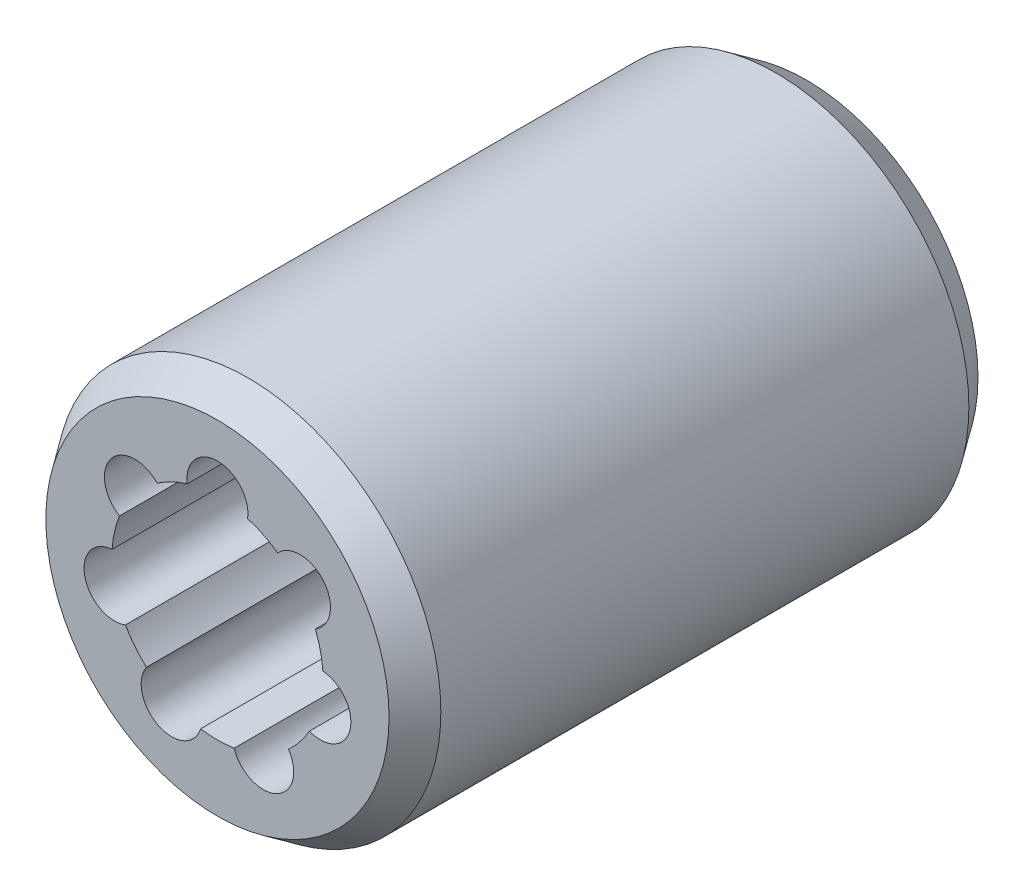
ISO-10303-21;
HEADER;
FILE_DESCRIPTION(('STEP AP214'),'2;1');
FILE_NAME('part.step','',(''),(''),'','','');
FILE_SCHEMA(('AUTOMOTIVE_DESIGN { 1 0 10303 214 1 1 1 1 }'));
ENDSEC;
DATA;
#1=APPLICATION_CONTEXT('core data for automotive mechanical design processes');
#2=APPLICATION_PROTOCOL_DEFINITION('international standard','automotive_design',2000,#1);
#3=PRODUCT_CONTEXT('',#1,'mechanical');
#4=PRODUCT('Part','Part','',(#3));
#5=PRODUCT_RELATED_PRODUCT_CATEGORY('part','',(#4));
#6=PRODUCT_DEFINITION_FORMATION('','',#4);
#7=PRODUCT_DEFINITION_CONTEXT('part definition',#1,'design');
#8=PRODUCT_DEFINITION('design','',#6,#7);
#9=PRODUCT_DEFINITION_SHAPE('','',#8);
#10=(LENGTH_UNIT() NAMED_UNIT(*) SI_UNIT(.MILLI.,.METRE.));
#11=(NAMED_UNIT(*) PLANE_ANGLE_UNIT() SI_UNIT($,.RADIAN.));
#12=(NAMED_UNIT(*) SI_UNIT($,.STERADIAN.) SOLID_ANGLE_UNIT());
#13=UNCERTAINTY_MEASURE_WITH_UNIT(LENGTH_MEASURE(1.E-05),#10,'distance_accuracy_value','');
#14=(GEOMETRIC_REPRESENTATION_CONTEXT(3) GLOBAL_UNCERTAINTY_ASSIGNED_CONTEXT((#13)) GLOBAL_UNIT_ASSIGNED_CONTEXT((#10,
#11,#12)) REPRESENTATION_CONTEXT('',''));
#15=CARTESIAN_POINT('',(0.,0.,0.));
#16=DIRECTION('',(0.,0.,1.));
#17=DIRECTION('',(1.,0.,0.));
#18=AXIS2_PLACEMENT_3D('',#15,#16,#17);
#19=CARTESIAN_POINT('',(0.,0.,29.));
#20=DIRECTION('',(0.,0.,-1.));
#21=DIRECTION('',(-1.,0.,0.));
#22=AXIS2_PLACEMENT_3D('',#19,#20,#21);
#23=CYLINDRICAL_SURFACE('',#22,5.2);
#24=DIRECTION('',(0.,0.,1.));
#25=VECTOR('',#24,1.);
#26=CARTESIAN_POINT('',(-2.97092151159038,4.26774242099609,14.5));
#27=LINE('',#26,#25);
#28=CARTESIAN_POINT('',(-2.97092151159038,4.26774242099609,0.));
#29=VERTEX_POINT('',#28);
#30=CARTESIAN_POINT('',(-2.97092151159038,4.26774242099609,29.));
#31=VERTEX_POINT('',#30);
#32=EDGE_CURVE('E139',#29,#31,#27,.T.);
#33=ORIENTED_EDGE('',*,*,#32,.F.);
#34=CARTESIAN_POINT('',(0.,0.,0.));
#35=DIRECTION('',(0.,0.,1.));
#36=DIRECTION('',(1.,0.,0.));
#37=AXIS2_PLACEMENT_3D('',#34,#35,#36);
#38=CIRCLE('',#37,5.2);
#39=CARTESIAN_POINT('',(-1.48431611919967,4.98365384615385,0.));
#40=VERTEX_POINT('',#39);
#41=EDGE_CURVE('E151',#40,#29,#38,.T.);
#42=ORIENTED_EDGE('',*,*,#41,.F.);
#43=DIRECTION('',(0.,0.,1.));
#44=VECTOR('',#43,1.);
#45=CARTESIAN_POINT('',(-1.48431611919967,4.98365384615385,14.5));
#46=LINE('',#45,#44);
#47=CARTESIAN_POINT('',(-1.48431611919967,4.98365384615385,29.));
#48=VERTEX_POINT('',#47);
#49=EDGE_CURVE('E179',#48,#40,#46,.F.);
#50=ORIENTED_EDGE('',*,*,#49,.F.);
#51=CARTESIAN_POINT('',(0.,0.,29.));
#52=DIRECTION('',(0.,0.,1.));
#53=DIRECTION('',(1.,0.,0.));
#54=AXIS2_PLACEMENT_3D('',#51,#52,#53);
#55=CIRCLE('',#54,5.2);
#56=EDGE_CURVE('E153',#48,#31,#55,.T.);
#57=ORIENTED_EDGE('',*,*,#56,.T.);
#58=EDGE_LOOP('',(#33,#42,#50,#57));
#59=FACE_BOUND('',#58,.T.);
#60=ADVANCED_FACE('F37',(#59),#23,.F.);
#61=DIRECTION('',(0.,0.,1.));
#62=VECTOR('',#61,1.);
#63=CARTESIAN_POINT('',(-4.82183343770147,1.94677227714596,14.5));
#64=LINE('',#63,#62);
#65=CARTESIAN_POINT('',(-4.82183343770147,1.94677227714596,29.));
#66=VERTEX_POINT('',#65);
#67=CARTESIAN_POINT('',(-4.82183343770147,1.94677227714596,0.));
#68=VERTEX_POINT('',#67);
#69=EDGE_CURVE('E52',#66,#68,#64,.F.);
#70=ORIENTED_EDGE('',*,*,#69,.F.);
#71=CARTESIAN_POINT('',(-5.1889946483984,0.338133906748081,29.));
#72=VERTEX_POINT('',#71);
#73=EDGE_CURVE('E180',#66,#72,#55,.T.);
#74=ORIENTED_EDGE('',*,*,#73,.T.);
#75=DIRECTION('',(0.,0.,1.));
#76=VECTOR('',#75,1.);
#77=CARTESIAN_POINT('',(-5.1889946483984,0.338133906748082,14.5));
#78=LINE('',#77,#76);
#79=CARTESIAN_POINT('',(-5.1889946483984,0.338133906748081,0.));
#80=VERTEX_POINT('',#79);
#81=EDGE_CURVE('E245',#80,#72,#78,.T.);
#82=ORIENTED_EDGE('',*,*,#81,.F.);
#83=EDGE_CURVE('E161',#68,#80,#38,.T.);
#84=ORIENTED_EDGE('',*,*,#83,.F.);
#85=EDGE_LOOP('',(#70,#74,#82,#84));
#86=FACE_BOUND('',#85,.T.);
#87=ADVANCED_FACE('F251',(#86),#23,.F.);
#88=DIRECTION('',(0.,0.,1.));
#89=VECTOR('',#88,1.);
#90=CARTESIAN_POINT('',(-4.52841183013699,-2.55606852347025,14.5));
#91=LINE('',#90,#89);
#92=CARTESIAN_POINT('',(-4.52841183013699,-2.55606852347025,29.));
#93=VERTEX_POINT('',#92);
#94=CARTESIAN_POINT('',(-4.52841183013699,-2.55606852347025,0.));
#95=VERTEX_POINT('',#94);
#96=EDGE_CURVE('E60',#93,#95,#91,.F.);
#97=ORIENTED_EDGE('',*,*,#96,.F.);
#98=CARTESIAN_POINT('',(-3.4996489787615,-3.84609633595592,29.));
#99=VERTEX_POINT('',#98);
#100=EDGE_CURVE('E182',#93,#99,#55,.T.);
#101=ORIENTED_EDGE('',*,*,#100,.T.);
#102=DIRECTION('',(0.,0.,1.));
#103=VECTOR('',#102,1.);
#104=CARTESIAN_POINT('',(-3.4996489787615,-3.84609633595592,14.5));
#105=LINE('',#104,#103);
#106=CARTESIAN_POINT('',(-3.4996489787615,-3.84609633595592,0.));
#107=VERTEX_POINT('',#106);
#108=EDGE_CURVE('E239',#107,#99,#105,.T.);
#109=ORIENTED_EDGE('',*,*,#108,.F.);
#110=EDGE_CURVE('E166',#95,#107,#38,.T.);
#111=ORIENTED_EDGE('',*,*,#110,.F.);
#112=EDGE_LOOP('',(#97,#101,#109,#111));
#113=FACE_BOUND('',#112,.T.);
#114=ADVANCED_FACE('F256',(#113),#23,.F.);
#115=DIRECTION('',(0.,0.,1.));
#116=VECTOR('',#115,1.);
#117=CARTESIAN_POINT('',(-0.82500375171223,-5.13413759161758,14.5));
#118=LINE('',#117,#116);
#119=CARTESIAN_POINT('',(-0.82500375171223,-5.13413759161758,29.));
#120=VERTEX_POINT('',#119);
#121=CARTESIAN_POINT('',(-0.825003751712229,-5.13413759161758,0.));
#122=VERTEX_POINT('',#121);
#123=EDGE_CURVE('E241',#120,#122,#118,.F.);
#124=ORIENTED_EDGE('',*,*,#123,.F.);
#125=CARTESIAN_POINT('',(0.825003751712158,-5.13413759161759,29.));
#126=VERTEX_POINT('',#125);
#127=EDGE_CURVE('E187',#120,#126,#55,.T.);
#128=ORIENTED_EDGE('',*,*,#127,.T.);
#129=DIRECTION('',(0.,0.,1.));
#130=VECTOR('',#129,1.);
#131=CARTESIAN_POINT('',(0.825003751712158,-5.13413759161759,14.5));
#132=LINE('',#131,#130);
#133=CARTESIAN_POINT('',(0.825003751712158,-5.13413759161759,0.));
#134=VERTEX_POINT('',#133);
#135=EDGE_CURVE('E233',#134,#126,#132,.T.);
#136=ORIENTED_EDGE('',*,*,#135,.F.);
#137=EDGE_CURVE('E259',#122,#134,#38,.T.);
#138=ORIENTED_EDGE('',*,*,#137,.F.);
#139=EDGE_LOOP('',(#124,#128,#136,#138));
#140=FACE_BOUND('',#139,.T.);
#141=ADVANCED_FACE('F270',(#140),#23,.F.);
#142=DIRECTION('',(0.,0.,1.));
#143=VECTOR('',#142,1.);
#144=CARTESIAN_POINT('',(3.49964897876145,-3.84609633595597,14.5));
#145=LINE('',#144,#143);
#146=CARTESIAN_POINT('',(3.49964897876145,-3.84609633595597,29.));
#147=VERTEX_POINT('',#146);
#148=CARTESIAN_POINT('',(3.49964897876145,-3.84609633595597,0.));
#149=VERTEX_POINT('',#148);
#150=EDGE_CURVE('E235',#147,#149,#145,.F.);
#151=ORIENTED_EDGE('',*,*,#150,.F.);
#152=CARTESIAN_POINT('',(4.52841183013695,-2.55606852347031,29.));
#153=VERTEX_POINT('',#152);
#154=EDGE_CURVE('E192',#147,#153,#55,.T.);
#155=ORIENTED_EDGE('',*,*,#154,.T.);
#156=DIRECTION('',(0.,0.,1.));
#157=VECTOR('',#156,1.);
#158=CARTESIAN_POINT('',(4.52841183013695,-2.55606852347031,14.5));
#159=LINE('',#158,#157);
#160=CARTESIAN_POINT('',(4.52841183013695,-2.55606852347031,0.));
#161=VERTEX_POINT('',#160);
#162=EDGE_CURVE('E225',#161,#153,#159,.T.);
#163=ORIENTED_EDGE('',*,*,#162,.F.);
#164=EDGE_CURVE('E171',#149,#161,#38,.T.);
#165=ORIENTED_EDGE('',*,*,#164,.F.);
#166=EDGE_LOOP('',(#151,#155,#163,#165));
#167=FACE_BOUND('',#166,.T.);
#168=ADVANCED_FACE('F268',(#167),#23,.F.);
#169=DIRECTION('',(0.,0.,1.));
#170=VECTOR('',#169,1.);
#171=CARTESIAN_POINT('',(5.18899464839841,0.338133906748011,14.5));
#172=LINE('',#171,#170);
#173=CARTESIAN_POINT('',(5.18899464839841,0.338133906748011,29.));
#174=VERTEX_POINT('',#173);
#175=CARTESIAN_POINT('',(5.18899464839841,0.338133906748011,0.));
#176=VERTEX_POINT('',#175);
#177=EDGE_CURVE('E211',#174,#176,#172,.F.);
#178=ORIENTED_EDGE('',*,*,#177,.F.);
#179=CARTESIAN_POINT('',(4.82183343770149,1.94677227714589,29.));
#180=VERTEX_POINT('',#179);
#181=EDGE_CURVE('E164',#174,#180,#55,.T.);
#182=ORIENTED_EDGE('',*,*,#181,.T.);
#183=DIRECTION('',(0.,0.,1.));
#184=VECTOR('',#183,1.);
#185=CARTESIAN_POINT('',(4.82183343770149,1.94677227714589,14.5));
#186=LINE('',#185,#184);
#187=CARTESIAN_POINT('',(4.82183343770149,1.94677227714589,0.));
#188=VERTEX_POINT('',#187);
#189=EDGE_CURVE('E210',#188,#180,#186,.T.);
#190=ORIENTED_EDGE('',*,*,#189,.F.);
#191=EDGE_CURVE('E168',#176,#188,#38,.T.);
#192=ORIENTED_EDGE('',*,*,#191,.F.);
#193=EDGE_LOOP('',(#178,#182,#190,#192));
#194=FACE_BOUND('',#193,.T.);
#195=ADVANCED_FACE('F208',(#194),#23,.F.);
#196=CARTESIAN_POINT('',(0.,0.,29.));
#197=DIRECTION('',(0.,0.,1.));
#198=DIRECTION('',(1.,0.,0.));
#199=AXIS2_PLACEMENT_3D('',#196,#197,#198);
#200=PLANE('',#199);
#201=CARTESIAN_POINT('',(0.,0.,29.));
#202=DIRECTION('',(0.,0.,1.));
#203=DIRECTION('',(1.,0.,0.));
#204=AXIS2_PLACEMENT_3D('',#201,#202,#203);
#205=CIRCLE('',#204,8.44968869268545);
#206=CARTESIAN_POINT('',(8.44968869268545,0.,29.));
#207=VERTEX_POINT('',#206);
#208=EDGE_CURVE('E11',#207,#207,#205,.T.);
#209=ORIENTED_EDGE('',*,*,#208,.T.);
#210=EDGE_LOOP('',(#209));
#211=FACE_BOUND('',#210,.T.);
#212=CARTESIAN_POINT('',(-4.06552370883372,3.24214696966546,29.));
#213=DIRECTION('',(0.,0.,1.));
#214=DIRECTION('',(0.623489801858743,0.781831482468022,0.));
#215=AXIS2_PLACEMENT_3D('',#212,#213,#214);
#216=CIRCLE('',#215,1.5);
#217=EDGE_CURVE('E250',#31,#66,#216,.T.);
#218=ORIENTED_EDGE('',*,*,#217,.F.);
#219=ORIENTED_EDGE('',*,*,#56,.F.);
#220=CARTESIAN_POINT('',(0.,5.2,29.));
#221=DIRECTION('',(0.,0.,1.));
#222=DIRECTION('',(1.,0.,0.));
#223=AXIS2_PLACEMENT_3D('',#220,#221,#222);
#224=CIRCLE('',#223,1.5);
#225=CARTESIAN_POINT('',(1.48431611919967,4.98365384615385,29.));
#226=VERTEX_POINT('',#225);
#227=EDGE_CURVE('E172',#226,#48,#224,.T.);
#228=ORIENTED_EDGE('',*,*,#227,.F.);
#229=CARTESIAN_POINT('',(2.97092151159044,4.26774242099604,29.));
#230=VERTEX_POINT('',#229);
#231=EDGE_CURVE('E160',#230,#226,#55,.T.);
#232=ORIENTED_EDGE('',*,*,#231,.F.);
#233=CARTESIAN_POINT('',(4.06552370883376,3.24214696966541,29.));
#234=DIRECTION('',(0.,0.,1.));
#235=DIRECTION('',(0.623489801858732,-0.781831482468031,0.));
#236=AXIS2_PLACEMENT_3D('',#233,#234,#235);
#237=CIRCLE('',#236,1.5);
#238=EDGE_CURVE('E177',#180,#230,#237,.T.);
#239=ORIENTED_EDGE('',*,*,#238,.F.);
#240=ORIENTED_EDGE('',*,*,#181,.F.);
#241=CARTESIAN_POINT('',(5.06962514334548,-1.15710885657285,29.));
#242=DIRECTION('',(0.,0.,1.));
#243=DIRECTION('',(-0.222520933956318,-0.974927912181823,0.));
#244=AXIS2_PLACEMENT_3D('',#241,#242,#243);
#245=CIRCLE('',#244,1.5);
#246=EDGE_CURVE('E229',#153,#174,#245,.T.);
#247=ORIENTED_EDGE('',*,*,#246,.F.);
#248=ORIENTED_EDGE('',*,*,#154,.F.);
#249=CARTESIAN_POINT('',(2.25619544341127,-4.68503811309259,29.));
#250=DIRECTION('',(0.,0.,1.));
#251=DIRECTION('',(-0.900968867902422,-0.433883739117553,0.));
#252=AXIS2_PLACEMENT_3D('',#249,#250,#251);
#253=CIRCLE('',#252,1.5);
#254=EDGE_CURVE('E237',#126,#147,#253,.T.);
#255=ORIENTED_EDGE('',*,*,#254,.F.);
#256=ORIENTED_EDGE('',*,*,#127,.F.);
#257=CARTESIAN_POINT('',(-2.25619544341134,-4.68503811309256,29.));
#258=DIRECTION('',(0.,0.,1.));
#259=DIRECTION('',(-0.900968867902416,0.433883739117565,0.));
#260=AXIS2_PLACEMENT_3D('',#257,#258,#259);
#261=CIRCLE('',#260,1.5);
#262=EDGE_CURVE('E243',#99,#120,#261,.T.);
#263=ORIENTED_EDGE('',*,*,#262,.F.);
#264=ORIENTED_EDGE('',*,*,#100,.F.);
#265=CARTESIAN_POINT('',(-5.06962514334549,-1.15710885657279,29.));
#266=DIRECTION('',(0.,0.,1.));
#267=DIRECTION('',(-0.222520933956305,0.974927912181826,0.));
#268=AXIS2_PLACEMENT_3D('',#265,#266,#267);
#269=CIRCLE('',#268,1.5);
#270=EDGE_CURVE('E154',#72,#93,#269,.T.);
#271=ORIENTED_EDGE('',*,*,#270,.F.);
#272=ORIENTED_EDGE('',*,*,#73,.F.);
#273=EDGE_LOOP('',(#218,#219,#228,#232,#239,#240,#247,#248,#255,#256,#263,#264,#271,#272));
#274=FACE_BOUND('',#273,.T.);
#275=ADVANCED_FACE('F223',(#211,#274),#200,.T.);
#276=CARTESIAN_POINT('',(0.,0.,0.));
#277=DIRECTION('',(0.,0.,1.));
#278=DIRECTION('',(1.,0.,0.));
#279=AXIS2_PLACEMENT_3D('',#276,#277,#278);
#280=PLANE('',#279);
#281=CARTESIAN_POINT('',(0.,0.,0.));
#282=DIRECTION('',(0.,0.,1.));
#283=DIRECTION('',(1.,0.,0.));
#284=AXIS2_PLACEMENT_3D('',#281,#282,#283);
#285=CIRCLE('',#284,8.44968869268544);
#286=CARTESIAN_POINT('',(8.44968869268544,0.,0.));
#287=VERTEX_POINT('',#286);
#288=EDGE_CURVE('E45',#287,#287,#285,.F.);
#289=ORIENTED_EDGE('',*,*,#288,.T.);
#290=EDGE_LOOP('',(#289));
#291=FACE_BOUND('',#290,.T.);
#292=ORIENTED_EDGE('',*,*,#41,.T.);
#293=CARTESIAN_POINT('',(-4.06552370883372,3.24214696966546,0.));
#294=DIRECTION('',(0.,0.,1.));
#295=DIRECTION('',(1.,0.,0.));
#296=AXIS2_PLACEMENT_3D('',#293,#294,#295);
#297=CIRCLE('',#296,1.5);
#298=EDGE_CURVE('E136',#29,#68,#297,.T.);
#299=ORIENTED_EDGE('',*,*,#298,.T.);
#300=ORIENTED_EDGE('',*,*,#83,.T.);
#301=CARTESIAN_POINT('',(-5.06962514334549,-1.15710885657279,0.));
#302=DIRECTION('',(0.,0.,1.));
#303=DIRECTION('',(1.,0.,0.));
#304=AXIS2_PLACEMENT_3D('',#301,#302,#303);
#305=CIRCLE('',#304,1.5);
#306=EDGE_CURVE('E145',#80,#95,#305,.T.);
#307=ORIENTED_EDGE('',*,*,#306,.T.);
#308=ORIENTED_EDGE('',*,*,#110,.T.);
#309=CARTESIAN_POINT('',(-2.25619544341134,-4.68503811309256,0.));
#310=DIRECTION('',(0.,0.,1.));
#311=DIRECTION('',(1.,0.,0.));
#312=AXIS2_PLACEMENT_3D('',#309,#310,#311);
#313=CIRCLE('',#312,1.5);
#314=EDGE_CURVE('E300',#107,#122,#313,.T.);
#315=ORIENTED_EDGE('',*,*,#314,.T.);
#316=ORIENTED_EDGE('',*,*,#137,.T.);
#317=CARTESIAN_POINT('',(2.25619544341127,-4.68503811309259,0.));
#318=DIRECTION('',(0.,0.,1.));
#319=DIRECTION('',(1.,0.,0.));
#320=AXIS2_PLACEMENT_3D('',#317,#318,#319);
#321=CIRCLE('',#320,1.5);
#322=EDGE_CURVE('E265',#134,#149,#321,.T.);
#323=ORIENTED_EDGE('',*,*,#322,.T.);
#324=ORIENTED_EDGE('',*,*,#164,.T.);
#325=CARTESIAN_POINT('',(5.06962514334548,-1.15710885657285,0.));
#326=DIRECTION('',(0.,0.,1.));
#327=DIRECTION('',(1.,0.,0.));
#328=AXIS2_PLACEMENT_3D('',#325,#326,#327);
#329=CIRCLE('',#328,1.5);
#330=EDGE_CURVE('E219',#161,#176,#329,.T.);
#331=ORIENTED_EDGE('',*,*,#330,.T.);
#332=ORIENTED_EDGE('',*,*,#191,.T.);
#333=CARTESIAN_POINT('',(4.06552370883376,3.24214696966541,0.));
#334=DIRECTION('',(0.,0.,1.));
#335=DIRECTION('',(0.623489801858732,-0.781831482468031,0.));
#336=AXIS2_PLACEMENT_3D('',#333,#334,#335);
#337=CIRCLE('',#336,1.5);
#338=CARTESIAN_POINT('',(2.97092151159044,4.26774242099604,0.));
#339=VERTEX_POINT('',#338);
#340=EDGE_CURVE('E174',#188,#339,#337,.T.);
#341=ORIENTED_EDGE('',*,*,#340,.T.);
#342=CARTESIAN_POINT('',(1.48431611919967,4.98365384615385,0.));
#343=VERTEX_POINT('',#342);
#344=EDGE_CURVE('E163',#339,#343,#38,.T.);
#345=ORIENTED_EDGE('',*,*,#344,.T.);
#346=CARTESIAN_POINT('',(0.,5.2,0.));
#347=DIRECTION('',(0.,0.,1.));
#348=DIRECTION('',(1.,0.,0.));
#349=AXIS2_PLACEMENT_3D('',#346,#347,#348);
#350=CIRCLE('',#349,1.5);
#351=EDGE_CURVE('E159',#343,#40,#350,.T.);
#352=ORIENTED_EDGE('',*,*,#351,.T.);
#353=EDGE_LOOP('',(#292,#299,#300,#307,#308,#315,#316,#323,#324,#331,#332,#341,#345,#352));
#354=FACE_BOUND('',#353,.T.);
#355=ADVANCED_FACE('F157',(#291,#354),#280,.F.);
#356=CARTESIAN_POINT('',(0.,0.,29.));
#357=DIRECTION('',(0.,0.,-1.));
#358=DIRECTION('',(-1.,0.,0.));
#359=AXIS2_PLACEMENT_3D('',#356,#357,#358);
#360=CYLINDRICAL_SURFACE('',#359,9.5);
#361=CARTESIAN_POINT('',(0.,0.,1.49999999999999));
#362=DIRECTION('',(0.,0.,1.));
#363=DIRECTION('',(1.,0.,0.));
#364=AXIS2_PLACEMENT_3D('',#361,#362,#363);
#365=CIRCLE('',#364,9.5);
#366=CARTESIAN_POINT('',(9.5,0.,1.49999999999999));
#367=VERTEX_POINT('',#366);
#368=EDGE_CURVE('E305',#367,#367,#365,.T.);
#369=ORIENTED_EDGE('',*,*,#368,.T.);
#370=EDGE_LOOP('',(#369));
#371=FACE_BOUND('',#370,.T.);
#372=CARTESIAN_POINT('',(0.,0.,27.5));
#373=DIRECTION('',(0.,0.,1.));
#374=DIRECTION('',(1.,0.,0.));
#375=AXIS2_PLACEMENT_3D('',#372,#373,#374);
#376=CIRCLE('',#375,9.5);
#377=CARTESIAN_POINT('',(9.5,0.,27.5));
#378=VERTEX_POINT('',#377);
#379=EDGE_CURVE('E144',#378,#378,#376,.F.);
#380=ORIENTED_EDGE('',*,*,#379,.T.);
#381=EDGE_LOOP('',(#380));
#382=FACE_BOUND('',#381,.T.);
#383=ADVANCED_FACE('F285',(#371,#382),#360,.T.);
#384=DIRECTION('',(0.,0.,1.));
#385=VECTOR('',#384,1.);
#386=CARTESIAN_POINT('',(2.97092151159044,4.26774242099604,14.5));
#387=LINE('',#386,#385);
#388=EDGE_CURVE('E220',#230,#339,#387,.F.);
#389=ORIENTED_EDGE('',*,*,#388,.F.);
#390=ORIENTED_EDGE('',*,*,#231,.T.);
#391=DIRECTION('',(0.,0.,1.));
#392=VECTOR('',#391,1.);
#393=CARTESIAN_POINT('',(1.48431611919967,4.98365384615385,14.5));
#394=LINE('',#393,#392);
#395=EDGE_CURVE('E181',#343,#226,#394,.T.);
#396=ORIENTED_EDGE('',*,*,#395,.F.);
#397=ORIENTED_EDGE('',*,*,#344,.F.);
#398=EDGE_LOOP('',(#389,#390,#396,#397));
#399=FACE_BOUND('',#398,.T.);
#400=ADVANCED_FACE('F276',(#399),#23,.F.);
#401=CARTESIAN_POINT('',(0.,5.2,0.));
#402=DIRECTION('',(0.,0.,1.));
#403=DIRECTION('',(1.,0.,0.));
#404=AXIS2_PLACEMENT_3D('',#401,#402,#403);
#405=CYLINDRICAL_SURFACE('',#404,1.5);
#406=ORIENTED_EDGE('',*,*,#395,.T.);
#407=ORIENTED_EDGE('',*,*,#227,.T.);
#408=ORIENTED_EDGE('',*,*,#49,.T.);
#409=ORIENTED_EDGE('',*,*,#351,.F.);
#410=EDGE_LOOP('',(#406,#407,#408,#409));
#411=FACE_BOUND('',#410,.T.);
#412=ADVANCED_FACE('F284',(#411),#405,.F.);
#413=CARTESIAN_POINT('',(4.06552370883376,3.24214696966541,0.));
#414=DIRECTION('',(0.,0.,1.));
#415=DIRECTION('',(1.,0.,0.));
#416=AXIS2_PLACEMENT_3D('',#413,#414,#415);
#417=CYLINDRICAL_SURFACE('',#416,1.5);
#418=ORIENTED_EDGE('',*,*,#189,.T.);
#419=ORIENTED_EDGE('',*,*,#238,.T.);
#420=ORIENTED_EDGE('',*,*,#388,.T.);
#421=ORIENTED_EDGE('',*,*,#340,.F.);
#422=EDGE_LOOP('',(#418,#419,#420,#421));
#423=FACE_BOUND('',#422,.T.);
#424=ADVANCED_FACE('F217',(#423),#417,.F.);
#425=CARTESIAN_POINT('',(5.06962514334548,-1.15710885657285,0.));
#426=DIRECTION('',(0.,0.,1.));
#427=DIRECTION('',(1.,0.,0.));
#428=AXIS2_PLACEMENT_3D('',#425,#426,#427);
#429=CYLINDRICAL_SURFACE('',#428,1.5);
#430=ORIENTED_EDGE('',*,*,#162,.T.);
#431=ORIENTED_EDGE('',*,*,#246,.T.);
#432=ORIENTED_EDGE('',*,*,#177,.T.);
#433=ORIENTED_EDGE('',*,*,#330,.F.);
#434=EDGE_LOOP('',(#430,#431,#432,#433));
#435=FACE_BOUND('',#434,.T.);
#436=ADVANCED_FACE('F266',(#435),#429,.F.);
#437=CARTESIAN_POINT('',(2.25619544341127,-4.68503811309259,0.));
#438=DIRECTION('',(0.,0.,1.));
#439=DIRECTION('',(1.,0.,0.));
#440=AXIS2_PLACEMENT_3D('',#437,#438,#439);
#441=CYLINDRICAL_SURFACE('',#440,1.5);
#442=ORIENTED_EDGE('',*,*,#135,.T.);
#443=ORIENTED_EDGE('',*,*,#254,.T.);
#444=ORIENTED_EDGE('',*,*,#150,.T.);
#445=ORIENTED_EDGE('',*,*,#322,.F.);
#446=EDGE_LOOP('',(#442,#443,#444,#445));
#447=FACE_BOUND('',#446,.T.);
#448=ADVANCED_FACE('F367',(#447),#441,.F.);
#449=CARTESIAN_POINT('',(-2.25619544341134,-4.68503811309256,0.));
#450=DIRECTION('',(0.,0.,1.));
#451=DIRECTION('',(1.,0.,0.));
#452=AXIS2_PLACEMENT_3D('',#449,#450,#451);
#453=CYLINDRICAL_SURFACE('',#452,1.5);
#454=ORIENTED_EDGE('',*,*,#108,.T.);
#455=ORIENTED_EDGE('',*,*,#262,.T.);
#456=ORIENTED_EDGE('',*,*,#123,.T.);
#457=ORIENTED_EDGE('',*,*,#314,.F.);
#458=EDGE_LOOP('',(#454,#455,#456,#457));
#459=FACE_BOUND('',#458,.T.);
#460=ADVANCED_FACE('F360',(#459),#453,.F.);
#461=CARTESIAN_POINT('',(-5.06962514334549,-1.15710885657279,0.));
#462=DIRECTION('',(0.,0.,1.));
#463=DIRECTION('',(1.,0.,0.));
#464=AXIS2_PLACEMENT_3D('',#461,#462,#463);
#465=CYLINDRICAL_SURFACE('',#464,1.5);
#466=ORIENTED_EDGE('',*,*,#81,.T.);
#467=ORIENTED_EDGE('',*,*,#270,.T.);
#468=ORIENTED_EDGE('',*,*,#96,.T.);
#469=ORIENTED_EDGE('',*,*,#306,.F.);
#470=EDGE_LOOP('',(#466,#467,#468,#469));
#471=FACE_BOUND('',#470,.T.);
#472=ADVANCED_FACE('F254',(#471),#465,.F.);
#473=CARTESIAN_POINT('',(-4.06552370883372,3.24214696966546,0.));
#474=DIRECTION('',(0.,0.,1.));
#475=DIRECTION('',(1.,0.,0.));
#476=AXIS2_PLACEMENT_3D('',#473,#474,#475);
#477=CYLINDRICAL_SURFACE('',#476,1.5);
#478=ORIENTED_EDGE('',*,*,#32,.T.);
#479=ORIENTED_EDGE('',*,*,#217,.T.);
#480=ORIENTED_EDGE('',*,*,#69,.T.);
#481=ORIENTED_EDGE('',*,*,#298,.F.);
#482=EDGE_LOOP('',(#478,#479,#480,#481));
#483=FACE_BOUND('',#482,.T.);
#484=ADVANCED_FACE('F138',(#483),#477,.F.);
#485=CARTESIAN_POINT('',(0.,0.,1.49999999999999));
#486=DIRECTION('',(0.,0.,1.));
#487=DIRECTION('',(1.,0.,0.));
#488=AXIS2_PLACEMENT_3D('',#485,#486,#487);
#489=CONICAL_SURFACE('',#488,9.5,0.610865238198014);
#490=ORIENTED_EDGE('',*,*,#288,.F.);
#491=EDGE_LOOP('',(#490));
#492=FACE_BOUND('',#491,.T.);
#493=ORIENTED_EDGE('',*,*,#368,.F.);
#494=EDGE_LOOP('',(#493));
#495=FACE_BOUND('',#494,.T.);
#496=ADVANCED_FACE('F311',(#492,#495),#489,.T.);
#497=CARTESIAN_POINT('',(0.,0.,29.));
#498=DIRECTION('',(0.,0.,-1.));
#499=DIRECTION('',(-1.,0.,0.));
#500=AXIS2_PLACEMENT_3D('',#497,#498,#499);
#501=CONICAL_SURFACE('',#500,8.44968869268545,0.610865238198014);
#502=ORIENTED_EDGE('',*,*,#379,.F.);
#503=EDGE_LOOP('',(#502));
#504=FACE_BOUND('',#503,.T.);
#505=ORIENTED_EDGE('',*,*,#208,.F.);
#506=EDGE_LOOP('',(#505));
#507=FACE_BOUND('',#506,.T.);
#508=ADVANCED_FACE('F39',(#504,#507),#501,.T.);
#509=CLOSED_SHELL('',(#60,#87,#114,#141,#168,#195,#275,#355,#383,#400,#412,#424,#436,#448,#460,
#472,#484,#496,#508));
#510=MANIFOLD_SOLID_BREP('B2',#509);
#511=ADVANCED_BREP_SHAPE_REPRESENTATION('',(#18,#510),#14);
#512=SHAPE_DEFINITION_REPRESENTATION(#9,#511);
ENDSEC;
END-ISO-10303-21;
